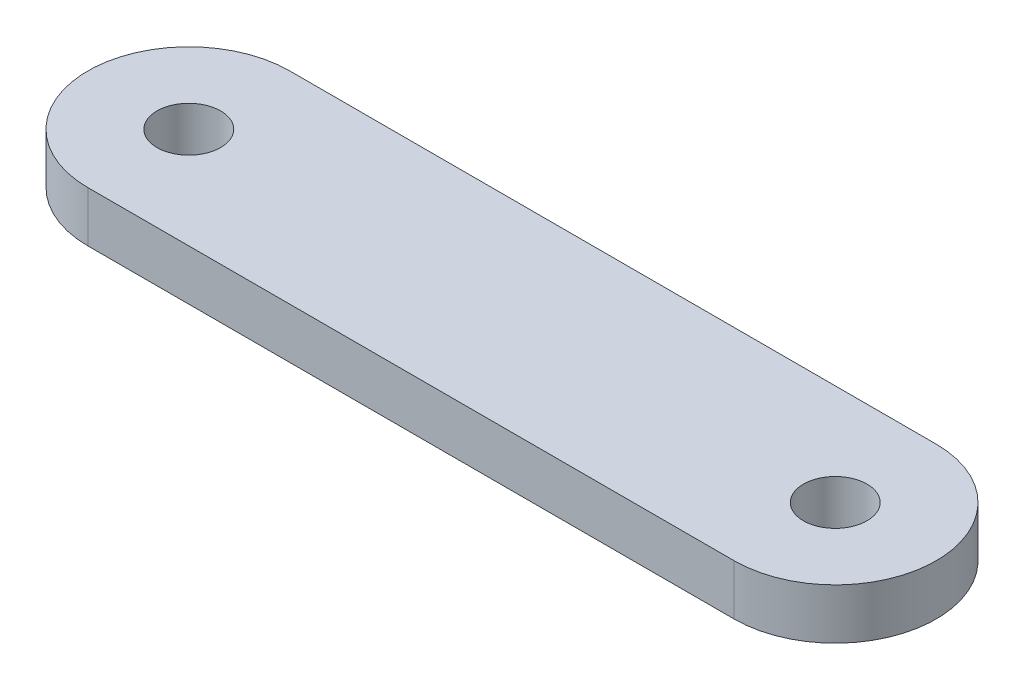
ISO-10303-21;
HEADER;
FILE_DESCRIPTION(('STEP AP214'),'2;1');
FILE_NAME('part.step','',(''),(''),'','','');
FILE_SCHEMA(('AUTOMOTIVE_DESIGN { 1 0 10303 214 1 1 1 1 }'));
ENDSEC;
DATA;
#1=APPLICATION_CONTEXT('core data for automotive mechanical design processes');
#2=APPLICATION_PROTOCOL_DEFINITION('international standard','automotive_design',2000,#1);
#3=PRODUCT_CONTEXT('',#1,'mechanical');
#4=PRODUCT('Part','Part','',(#3));
#5=PRODUCT_RELATED_PRODUCT_CATEGORY('part','',(#4));
#6=PRODUCT_DEFINITION_FORMATION('','',#4);
#7=PRODUCT_DEFINITION_CONTEXT('part definition',#1,'design');
#8=PRODUCT_DEFINITION('design','',#6,#7);
#9=PRODUCT_DEFINITION_SHAPE('','',#8);
#10=(LENGTH_UNIT() NAMED_UNIT(*) SI_UNIT(.MILLI.,.METRE.));
#11=(NAMED_UNIT(*) PLANE_ANGLE_UNIT() SI_UNIT($,.RADIAN.));
#12=(NAMED_UNIT(*) SI_UNIT($,.STERADIAN.) SOLID_ANGLE_UNIT());
#13=UNCERTAINTY_MEASURE_WITH_UNIT(LENGTH_MEASURE(1.E-05),#10,'distance_accuracy_value','');
#14=(GEOMETRIC_REPRESENTATION_CONTEXT(3) GLOBAL_UNCERTAINTY_ASSIGNED_CONTEXT((#13)) GLOBAL_UNIT_ASSIGNED_CONTEXT((#10,
#11,#12)) REPRESENTATION_CONTEXT('',''));
#15=CARTESIAN_POINT('',(0.,0.,0.));
#16=DIRECTION('',(0.,0.,1.));
#17=DIRECTION('',(1.,0.,0.));
#18=AXIS2_PLACEMENT_3D('',#15,#16,#17);
#19=CARTESIAN_POINT('',(-20.32,3.175,0.));
#20=DIRECTION('',(0.,1.,0.));
#21=DIRECTION('',(0.,0.,1.));
#22=AXIS2_PLACEMENT_3D('',#19,#20,#21);
#23=PLANE('',#22);
#24=CARTESIAN_POINT('',(-20.32,3.175,0.));
#25=DIRECTION('',(0.,1.,0.));
#26=DIRECTION('',(0.,0.,1.));
#27=AXIS2_PLACEMENT_3D('',#24,#25,#26);
#28=CIRCLE('',#27,2.000000064);
#29=CARTESIAN_POINT('',(-20.32,3.175,2.000000064));
#30=VERTEX_POINT('',#29);
#31=EDGE_CURVE('E104',#30,#30,#28,.T.);
#32=ORIENTED_EDGE('',*,*,#31,.F.);
#33=EDGE_LOOP('',(#32));
#34=FACE_BOUND('',#33,.T.);
#35=CARTESIAN_POINT('',(-20.32,3.175,0.));
#36=DIRECTION('',(0.,1.,0.));
#37=DIRECTION('',(0.,0.,1.));
#38=AXIS2_PLACEMENT_3D('',#35,#36,#37);
#39=CIRCLE('',#38,6.35);
#40=CARTESIAN_POINT('',(-20.32,3.175,-6.35));
#41=VERTEX_POINT('',#40);
#42=CARTESIAN_POINT('',(-20.32,3.175,6.35));
#43=VERTEX_POINT('',#42);
#44=EDGE_CURVE('E89',#41,#43,#39,.T.);
#45=ORIENTED_EDGE('',*,*,#44,.T.);
#46=DIRECTION('',(1.,0.,0.));
#47=VECTOR('',#46,1.);
#48=CARTESIAN_POINT('',(-20.32,3.175,6.35));
#49=LINE('',#48,#47);
#50=CARTESIAN_POINT('',(20.32,3.175,6.34999999999999));
#51=VERTEX_POINT('',#50);
#52=EDGE_CURVE('E84',#43,#51,#49,.T.);
#53=ORIENTED_EDGE('',*,*,#52,.T.);
#54=CARTESIAN_POINT('',(20.32,3.175,0.));
#55=DIRECTION('',(0.,1.,0.));
#56=DIRECTION('',(0.,0.,1.));
#57=AXIS2_PLACEMENT_3D('',#54,#55,#56);
#58=CIRCLE('',#57,6.35);
#59=CARTESIAN_POINT('',(20.32,3.175,-6.35000000000001));
#60=VERTEX_POINT('',#59);
#61=EDGE_CURVE('E87',#51,#60,#58,.T.);
#62=ORIENTED_EDGE('',*,*,#61,.T.);
#63=DIRECTION('',(-1.,0.,0.));
#64=VECTOR('',#63,1.);
#65=CARTESIAN_POINT('',(-20.32,3.175,-6.35));
#66=LINE('',#65,#64);
#67=EDGE_CURVE('E54',#60,#41,#66,.T.);
#68=ORIENTED_EDGE('',*,*,#67,.T.);
#69=EDGE_LOOP('',(#45,#53,#62,#68));
#70=FACE_BOUND('',#69,.T.);
#71=CARTESIAN_POINT('',(20.32,3.175,0.));
#72=DIRECTION('',(0.,1.,0.));
#73=DIRECTION('',(0.,0.,1.));
#74=AXIS2_PLACEMENT_3D('',#71,#72,#73);
#75=CIRCLE('',#74,2.000000064);
#76=CARTESIAN_POINT('',(20.32,3.175,2.000000064));
#77=VERTEX_POINT('',#76);
#78=EDGE_CURVE('E119',#77,#77,#75,.T.);
#79=ORIENTED_EDGE('',*,*,#78,.F.);
#80=EDGE_LOOP('',(#79));
#81=FACE_BOUND('',#80,.T.);
#82=ADVANCED_FACE('F37',(#34,#70,#81),#23,.T.);
#83=CARTESIAN_POINT('',(-20.32,0.,0.));
#84=DIRECTION('',(0.,1.,0.));
#85=DIRECTION('',(0.,0.,1.));
#86=AXIS2_PLACEMENT_3D('',#83,#84,#85);
#87=PLANE('',#86);
#88=CARTESIAN_POINT('',(-20.32,0.,0.));
#89=DIRECTION('',(0.,1.,0.));
#90=DIRECTION('',(0.,0.,1.));
#91=AXIS2_PLACEMENT_3D('',#88,#89,#90);
#92=CIRCLE('',#91,6.35);
#93=CARTESIAN_POINT('',(-20.32,0.,-6.35));
#94=VERTEX_POINT('',#93);
#95=CARTESIAN_POINT('',(-20.32,0.,6.35));
#96=VERTEX_POINT('',#95);
#97=EDGE_CURVE('E101',#94,#96,#92,.T.);
#98=ORIENTED_EDGE('',*,*,#97,.F.);
#99=DIRECTION('',(-1.,0.,0.));
#100=VECTOR('',#99,1.);
#101=CARTESIAN_POINT('',(-20.32,0.,-6.35));
#102=LINE('',#101,#100);
#103=CARTESIAN_POINT('',(20.32,0.,-6.35000000000001));
#104=VERTEX_POINT('',#103);
#105=EDGE_CURVE('E77',#104,#94,#102,.T.);
#106=ORIENTED_EDGE('',*,*,#105,.F.);
#107=CARTESIAN_POINT('',(20.32,0.,0.));
#108=DIRECTION('',(0.,1.,0.));
#109=DIRECTION('',(0.,0.,1.));
#110=AXIS2_PLACEMENT_3D('',#107,#108,#109);
#111=CIRCLE('',#110,6.35);
#112=CARTESIAN_POINT('',(20.32,0.,6.34999999999999));
#113=VERTEX_POINT('',#112);
#114=EDGE_CURVE('E71',#113,#104,#111,.T.);
#115=ORIENTED_EDGE('',*,*,#114,.F.);
#116=DIRECTION('',(1.,0.,0.));
#117=VECTOR('',#116,1.);
#118=CARTESIAN_POINT('',(-20.32,0.,6.35));
#119=LINE('',#118,#117);
#120=EDGE_CURVE('E93',#96,#113,#119,.T.);
#121=ORIENTED_EDGE('',*,*,#120,.F.);
#122=EDGE_LOOP('',(#98,#106,#115,#121));
#123=FACE_BOUND('',#122,.T.);
#124=CARTESIAN_POINT('',(-20.32,0.,0.));
#125=DIRECTION('',(0.,1.,0.));
#126=DIRECTION('',(0.,0.,1.));
#127=AXIS2_PLACEMENT_3D('',#124,#125,#126);
#128=CIRCLE('',#127,2.000000064);
#129=CARTESIAN_POINT('',(-20.32,0.,2.000000064));
#130=VERTEX_POINT('',#129);
#131=EDGE_CURVE('E116',#130,#130,#128,.T.);
#132=ORIENTED_EDGE('',*,*,#131,.T.);
#133=EDGE_LOOP('',(#132));
#134=FACE_BOUND('',#133,.T.);
#135=CARTESIAN_POINT('',(20.32,0.,0.));
#136=DIRECTION('',(0.,1.,0.));
#137=DIRECTION('',(0.,0.,1.));
#138=AXIS2_PLACEMENT_3D('',#135,#136,#137);
#139=CIRCLE('',#138,2.000000064);
#140=CARTESIAN_POINT('',(20.32,0.,2.000000064));
#141=VERTEX_POINT('',#140);
#142=EDGE_CURVE('E122',#141,#141,#139,.T.);
#143=ORIENTED_EDGE('',*,*,#142,.T.);
#144=EDGE_LOOP('',(#143));
#145=FACE_BOUND('',#144,.T.);
#146=ADVANCED_FACE('F112',(#123,#134,#145),#87,.F.);
#147=CARTESIAN_POINT('',(-20.32,3.175,0.));
#148=DIRECTION('',(0.,-1.,0.));
#149=DIRECTION('',(0.,0.,-1.));
#150=AXIS2_PLACEMENT_3D('',#147,#148,#149);
#151=CYLINDRICAL_SURFACE('',#150,6.35);
#152=ORIENTED_EDGE('',*,*,#97,.T.);
#153=DIRECTION('',(0.,-1.,0.));
#154=VECTOR('',#153,1.);
#155=CARTESIAN_POINT('',(-20.32,3.175,6.35));
#156=LINE('',#155,#154);
#157=EDGE_CURVE('E11',#43,#96,#156,.T.);
#158=ORIENTED_EDGE('',*,*,#157,.F.);
#159=ORIENTED_EDGE('',*,*,#44,.F.);
#160=DIRECTION('',(0.,-1.,0.));
#161=VECTOR('',#160,1.);
#162=CARTESIAN_POINT('',(-20.32,3.175,-6.35));
#163=LINE('',#162,#161);
#164=EDGE_CURVE('E97',#41,#94,#163,.T.);
#165=ORIENTED_EDGE('',*,*,#164,.T.);
#166=EDGE_LOOP('',(#152,#158,#159,#165));
#167=FACE_BOUND('',#166,.T.);
#168=ADVANCED_FACE('F39',(#167),#151,.T.);
#169=CARTESIAN_POINT('',(-20.32,3.175,6.35));
#170=DIRECTION('',(0.,0.,-1.));
#171=DIRECTION('',(-1.,0.,0.));
#172=AXIS2_PLACEMENT_3D('',#169,#170,#171);
#173=PLANE('',#172);
#174=ORIENTED_EDGE('',*,*,#120,.T.);
#175=DIRECTION('',(0.,-1.,0.));
#176=VECTOR('',#175,1.);
#177=CARTESIAN_POINT('',(20.32,3.175,6.34999999999999));
#178=LINE('',#177,#176);
#179=EDGE_CURVE('E46',#51,#113,#178,.T.);
#180=ORIENTED_EDGE('',*,*,#179,.F.);
#181=ORIENTED_EDGE('',*,*,#52,.F.);
#182=ORIENTED_EDGE('',*,*,#157,.T.);
#183=EDGE_LOOP('',(#174,#180,#181,#182));
#184=FACE_BOUND('',#183,.T.);
#185=ADVANCED_FACE('F92',(#184),#173,.F.);
#186=CARTESIAN_POINT('',(20.32,3.175,0.));
#187=DIRECTION('',(0.,-1.,0.));
#188=DIRECTION('',(0.,0.,-1.));
#189=AXIS2_PLACEMENT_3D('',#186,#187,#188);
#190=CYLINDRICAL_SURFACE('',#189,6.35);
#191=ORIENTED_EDGE('',*,*,#114,.T.);
#192=DIRECTION('',(0.,-1.,0.));
#193=VECTOR('',#192,1.);
#194=CARTESIAN_POINT('',(20.32,3.175,-6.35000000000001));
#195=LINE('',#194,#193);
#196=EDGE_CURVE('E94',#60,#104,#195,.T.);
#197=ORIENTED_EDGE('',*,*,#196,.F.);
#198=ORIENTED_EDGE('',*,*,#61,.F.);
#199=ORIENTED_EDGE('',*,*,#179,.T.);
#200=EDGE_LOOP('',(#191,#197,#198,#199));
#201=FACE_BOUND('',#200,.T.);
#202=ADVANCED_FACE('F95',(#201),#190,.T.);
#203=CARTESIAN_POINT('',(-20.32,3.175,-6.35));
#204=DIRECTION('',(0.,0.,1.));
#205=DIRECTION('',(1.,0.,0.));
#206=AXIS2_PLACEMENT_3D('',#203,#204,#205);
#207=PLANE('',#206);
#208=ORIENTED_EDGE('',*,*,#105,.T.);
#209=ORIENTED_EDGE('',*,*,#164,.F.);
#210=ORIENTED_EDGE('',*,*,#67,.F.);
#211=ORIENTED_EDGE('',*,*,#196,.T.);
#212=EDGE_LOOP('',(#208,#209,#210,#211));
#213=FACE_BOUND('',#212,.T.);
#214=ADVANCED_FACE('F109',(#213),#207,.F.);
#215=CARTESIAN_POINT('',(-20.32,3.175,0.));
#216=DIRECTION('',(0.,-1.,0.));
#217=DIRECTION('',(0.,0.,-1.));
#218=AXIS2_PLACEMENT_3D('',#215,#216,#217);
#219=CYLINDRICAL_SURFACE('',#218,2.000000064);
#220=ORIENTED_EDGE('',*,*,#31,.T.);
#221=EDGE_LOOP('',(#220));
#222=FACE_BOUND('',#221,.T.);
#223=ORIENTED_EDGE('',*,*,#131,.F.);
#224=EDGE_LOOP('',(#223));
#225=FACE_BOUND('',#224,.T.);
#226=ADVANCED_FACE('F139',(#222,#225),#219,.F.);
#227=CARTESIAN_POINT('',(20.32,3.175,0.));
#228=DIRECTION('',(0.,-1.,0.));
#229=DIRECTION('',(0.,0.,-1.));
#230=AXIS2_PLACEMENT_3D('',#227,#228,#229);
#231=CYLINDRICAL_SURFACE('',#230,2.000000064);
#232=ORIENTED_EDGE('',*,*,#78,.T.);
#233=EDGE_LOOP('',(#232));
#234=FACE_BOUND('',#233,.T.);
#235=ORIENTED_EDGE('',*,*,#142,.F.);
#236=EDGE_LOOP('',(#235));
#237=FACE_BOUND('',#236,.T.);
#238=ADVANCED_FACE('F128',(#234,#237),#231,.F.);
#239=CLOSED_SHELL('',(#82,#146,#168,#185,#202,#214,#226,#238));
#240=MANIFOLD_SOLID_BREP('B2',#239);
#241=ADVANCED_BREP_SHAPE_REPRESENTATION('',(#18,#240),#14);
#242=SHAPE_DEFINITION_REPRESENTATION(#9,#241);
ENDSEC;
END-ISO-10303-21;
